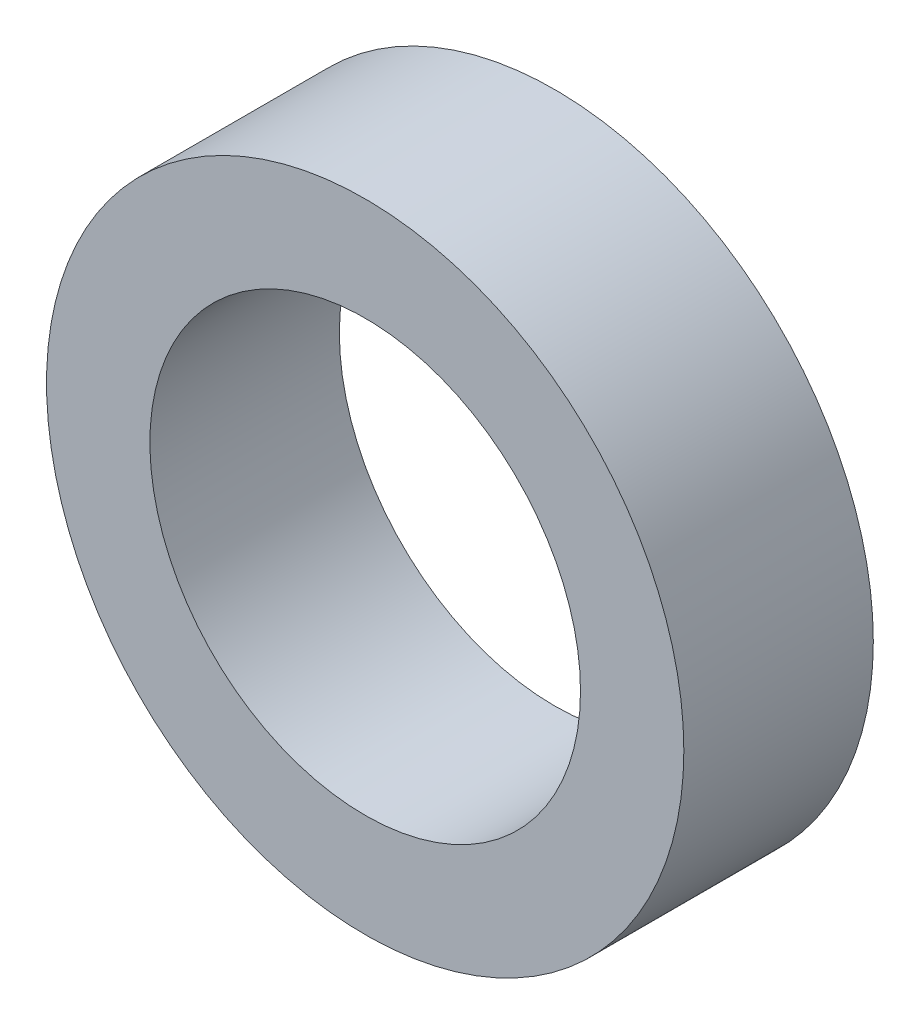
ISO-10303-21;
HEADER;
FILE_DESCRIPTION(('STEP AP214'),'2;1');
FILE_NAME('part.step','',(''),(''),'','','');
FILE_SCHEMA(('AUTOMOTIVE_DESIGN { 1 0 10303 214 1 1 1 1 }'));
ENDSEC;
DATA;
#1=APPLICATION_CONTEXT('core data for automotive mechanical design processes');
#2=APPLICATION_PROTOCOL_DEFINITION('international standard','automotive_design',2000,#1);
#3=PRODUCT_CONTEXT('',#1,'mechanical');
#4=PRODUCT('Part','Part','',(#3));
#5=PRODUCT_RELATED_PRODUCT_CATEGORY('part','',(#4));
#6=PRODUCT_DEFINITION_FORMATION('','',#4);
#7=PRODUCT_DEFINITION_CONTEXT('part definition',#1,'design');
#8=PRODUCT_DEFINITION('design','',#6,#7);
#9=PRODUCT_DEFINITION_SHAPE('','',#8);
#10=(LENGTH_UNIT() NAMED_UNIT(*) SI_UNIT(.MILLI.,.METRE.));
#11=(NAMED_UNIT(*) PLANE_ANGLE_UNIT() SI_UNIT($,.RADIAN.));
#12=(NAMED_UNIT(*) SI_UNIT($,.STERADIAN.) SOLID_ANGLE_UNIT());
#13=UNCERTAINTY_MEASURE_WITH_UNIT(LENGTH_MEASURE(1.E-05),#10,'distance_accuracy_value','');
#14=(GEOMETRIC_REPRESENTATION_CONTEXT(3) GLOBAL_UNCERTAINTY_ASSIGNED_CONTEXT((#13)) GLOBAL_UNIT_ASSIGNED_CONTEXT((#10,
#11,#12)) REPRESENTATION_CONTEXT('',''));
#15=CARTESIAN_POINT('',(0.,0.,0.));
#16=DIRECTION('',(0.,0.,1.));
#17=DIRECTION('',(1.,0.,0.));
#18=AXIS2_PLACEMENT_3D('',#15,#16,#17);
#19=CARTESIAN_POINT('',(0.,0.,-31.));
#20=DIRECTION('',(0.,0.,1.));
#21=DIRECTION('',(-0.383049008063239,0.923728021347068,0.));
#22=AXIS2_PLACEMENT_3D('',#19,#20,#21);
#23=PLANE('',#22);
#24=CARTESIAN_POINT('',(0.,0.,-31.));
#25=DIRECTION('',(0.,0.,1.));
#26=DIRECTION('',(1.,0.,0.));
#27=AXIS2_PLACEMENT_3D('',#24,#25,#26);
#28=CIRCLE('',#27,18.5);
#29=CARTESIAN_POINT('',(18.5,0.,-31.));
#30=VERTEX_POINT('',#29);
#31=EDGE_CURVE('E10',#30,#30,#28,.F.);
#32=ORIENTED_EDGE('',*,*,#31,.T.);
#33=EDGE_LOOP('',(#32));
#34=FACE_BOUND('',#33,.T.);
#35=CARTESIAN_POINT('',(0.,0.,-31.));
#36=DIRECTION('',(0.,0.,1.));
#37=DIRECTION('',(1.,0.,0.));
#38=AXIS2_PLACEMENT_3D('',#35,#36,#37);
#39=CIRCLE('',#38,12.5);
#40=CARTESIAN_POINT('',(12.5,0.,-31.));
#41=VERTEX_POINT('',#40);
#42=EDGE_CURVE('E22',#41,#41,#39,.F.);
#43=ORIENTED_EDGE('',*,*,#42,.F.);
#44=EDGE_LOOP('',(#43));
#45=FACE_BOUND('',#44,.T.);
#46=ADVANCED_FACE('F15',(#34,#45),#23,.F.);
#47=CARTESIAN_POINT('',(0.,0.,-20.));
#48=DIRECTION('',(0.,0.,1.));
#49=DIRECTION('',(1.,0.,0.));
#50=AXIS2_PLACEMENT_3D('',#47,#48,#49);
#51=PLANE('',#50);
#52=CARTESIAN_POINT('',(0.,0.,-20.));
#53=DIRECTION('',(0.,0.,1.));
#54=DIRECTION('',(-0.383049008063239,0.923728021347068,0.));
#55=AXIS2_PLACEMENT_3D('',#52,#53,#54);
#56=CIRCLE('',#55,18.5);
#57=CARTESIAN_POINT('',(-7.08640664916991,17.0889683949208,-20.));
#58=VERTEX_POINT('',#57);
#59=EDGE_CURVE('E37',#58,#58,#56,.T.);
#60=ORIENTED_EDGE('',*,*,#59,.T.);
#61=EDGE_LOOP('',(#60));
#62=FACE_BOUND('',#61,.T.);
#63=CARTESIAN_POINT('',(0.,0.,-20.));
#64=DIRECTION('',(0.,0.,1.));
#65=DIRECTION('',(-0.500000000000009,0.866025403784433,0.));
#66=AXIS2_PLACEMENT_3D('',#63,#64,#65);
#67=CIRCLE('',#66,12.5);
#68=CARTESIAN_POINT('',(-6.25000000000014,10.8253175473054,-20.));
#69=VERTEX_POINT('',#68);
#70=EDGE_CURVE('E30',#69,#69,#67,.T.);
#71=ORIENTED_EDGE('',*,*,#70,.F.);
#72=EDGE_LOOP('',(#71));
#73=FACE_BOUND('',#72,.T.);
#74=ADVANCED_FACE('F44',(#62,#73),#51,.T.);
#75=CARTESIAN_POINT('',(0.,0.,-128.9));
#76=DIRECTION('',(0.,0.,1.));
#77=DIRECTION('',(1.,0.,0.));
#78=AXIS2_PLACEMENT_3D('',#75,#76,#77);
#79=CYLINDRICAL_SURFACE('',#78,12.5);
#80=ORIENTED_EDGE('',*,*,#42,.T.);
#81=EDGE_LOOP('',(#80));
#82=FACE_BOUND('',#81,.T.);
#83=ORIENTED_EDGE('',*,*,#70,.T.);
#84=EDGE_LOOP('',(#83));
#85=FACE_BOUND('',#84,.T.);
#86=ADVANCED_FACE('F49',(#82,#85),#79,.F.);
#87=CARTESIAN_POINT('',(0.,0.,-128.9));
#88=DIRECTION('',(0.,0.,1.));
#89=DIRECTION('',(1.,0.,0.));
#90=AXIS2_PLACEMENT_3D('',#87,#88,#89);
#91=CYLINDRICAL_SURFACE('',#90,18.5);
#92=ORIENTED_EDGE('',*,*,#31,.F.);
#93=EDGE_LOOP('',(#92));
#94=FACE_BOUND('',#93,.T.);
#95=ORIENTED_EDGE('',*,*,#59,.F.);
#96=EDGE_LOOP('',(#95));
#97=FACE_BOUND('',#96,.T.);
#98=ADVANCED_FACE('F47',(#94,#97),#91,.T.);
#99=CLOSED_SHELL('',(#46,#74,#86,#98));
#100=MANIFOLD_SOLID_BREP('B1',#99);
#101=ADVANCED_BREP_SHAPE_REPRESENTATION('',(#18,#100),#14);
#102=SHAPE_DEFINITION_REPRESENTATION(#9,#101);
ENDSEC;
END-ISO-10303-21;
